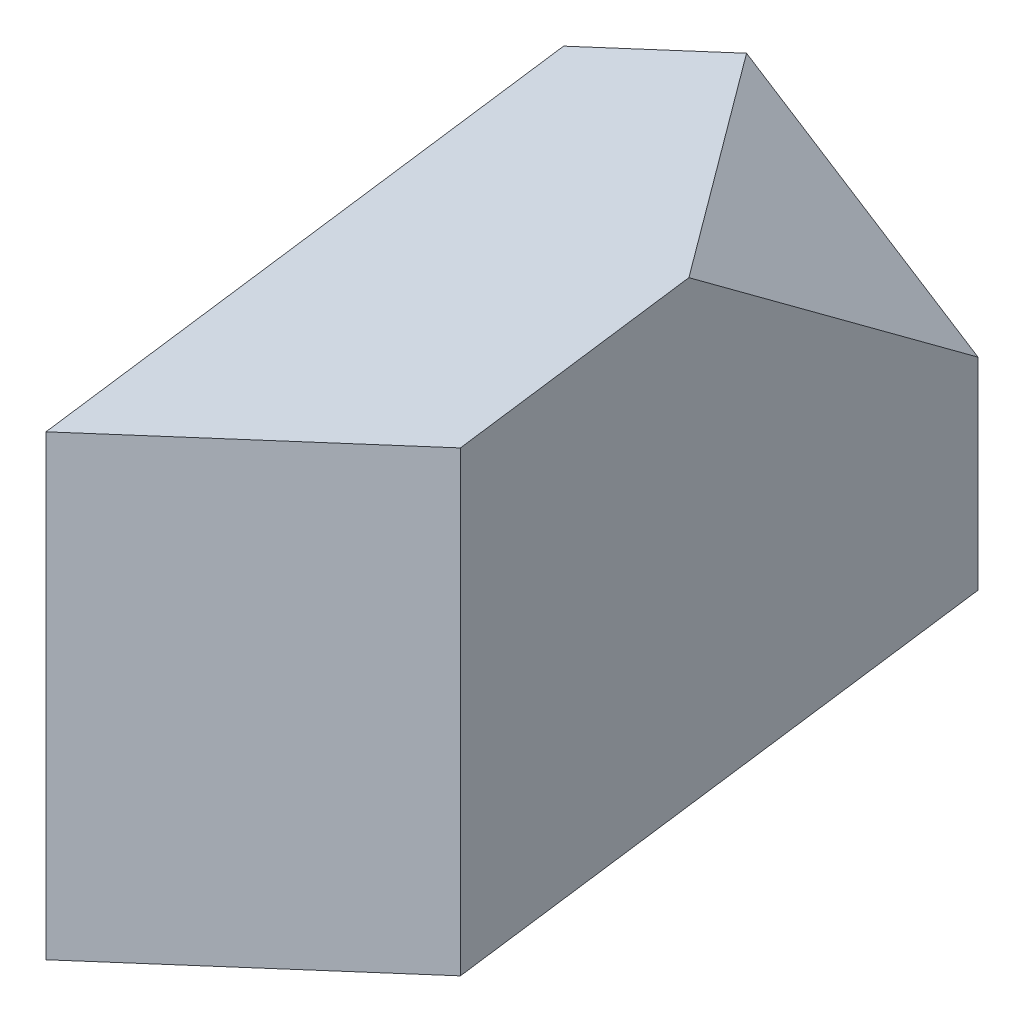
ISO-10303-21;
HEADER;
FILE_DESCRIPTION(('STEP AP214'),'2;1');
FILE_NAME('part.step','',(''),(''),'','','');
FILE_SCHEMA(('AUTOMOTIVE_DESIGN { 1 0 10303 214 1 1 1 1 }'));
ENDSEC;
DATA;
#1=APPLICATION_CONTEXT('core data for automotive mechanical design processes');
#2=APPLICATION_PROTOCOL_DEFINITION('international standard','automotive_design',2000,#1);
#3=PRODUCT_CONTEXT('',#1,'mechanical');
#4=PRODUCT('Part','Part','',(#3));
#5=PRODUCT_RELATED_PRODUCT_CATEGORY('part','',(#4));
#6=PRODUCT_DEFINITION_FORMATION('','',#4);
#7=PRODUCT_DEFINITION_CONTEXT('part definition',#1,'design');
#8=PRODUCT_DEFINITION('design','',#6,#7);
#9=PRODUCT_DEFINITION_SHAPE('','',#8);
#10=(LENGTH_UNIT() NAMED_UNIT(*) SI_UNIT(.MILLI.,.METRE.));
#11=(NAMED_UNIT(*) PLANE_ANGLE_UNIT() SI_UNIT($,.RADIAN.));
#12=(NAMED_UNIT(*) SI_UNIT($,.STERADIAN.) SOLID_ANGLE_UNIT());
#13=UNCERTAINTY_MEASURE_WITH_UNIT(LENGTH_MEASURE(1.E-05),#10,'distance_accuracy_value','');
#14=(GEOMETRIC_REPRESENTATION_CONTEXT(3) GLOBAL_UNCERTAINTY_ASSIGNED_CONTEXT((#13)) GLOBAL_UNIT_ASSIGNED_CONTEXT((#10,
#11,#12)) REPRESENTATION_CONTEXT('',''));
#15=CARTESIAN_POINT('',(0.,0.,0.));
#16=DIRECTION('',(0.,0.,1.));
#17=DIRECTION('',(1.,0.,0.));
#18=AXIS2_PLACEMENT_3D('',#15,#16,#17);
#19=CARTESIAN_POINT('',(0.,0.,0.));
#20=DIRECTION('',(0.,0.,-1.));
#21=DIRECTION('',(-1.,0.,0.));
#22=AXIS2_PLACEMENT_3D('',#19,#20,#21);
#23=PLANE('',#22);
#24=DIRECTION('',(0.,-1.,0.));
#25=VECTOR('',#24,1.);
#26=CARTESIAN_POINT('',(0.,0.,0.));
#27=LINE('',#26,#25);
#28=CARTESIAN_POINT('',(0.,60.,0.));
#29=VERTEX_POINT('',#28);
#30=CARTESIAN_POINT('',(0.,0.,0.));
#31=VERTEX_POINT('',#30);
#32=EDGE_CURVE('E108',#29,#31,#27,.T.);
#33=ORIENTED_EDGE('',*,*,#32,.T.);
#34=DIRECTION('',(0.906307787036651,0.422618261740697,0.));
#35=VECTOR('',#34,1.);
#36=CARTESIAN_POINT('',(0.,0.,0.));
#37=LINE('',#36,#35);
#38=CARTESIAN_POINT('',(54.3784672221991,25.3570957044419,0.));
#39=VERTEX_POINT('',#38);
#40=EDGE_CURVE('E99',#31,#39,#37,.T.);
#41=ORIENTED_EDGE('',*,*,#40,.T.);
#42=DIRECTION('',(0.,1.,0.));
#43=VECTOR('',#42,1.);
#44=CARTESIAN_POINT('',(54.3784672221991,25.3570957044419,0.));
#45=LINE('',#44,#43);
#46=CARTESIAN_POINT('',(54.3784672221991,85.3570957044419,0.));
#47=VERTEX_POINT('',#46);
#48=EDGE_CURVE('E102',#39,#47,#45,.T.);
#49=ORIENTED_EDGE('',*,*,#48,.T.);
#50=DIRECTION('',(-0.906307787036651,-0.422618261740697,0.));
#51=VECTOR('',#50,1.);
#52=CARTESIAN_POINT('',(0.,60.,0.));
#53=LINE('',#52,#51);
#54=EDGE_CURVE('E105',#47,#29,#53,.T.);
#55=ORIENTED_EDGE('',*,*,#54,.T.);
#56=EDGE_LOOP('',(#33,#41,#49,#55));
#57=FACE_BOUND('',#56,.T.);
#58=ADVANCED_FACE('F32',(#57),#23,.F.);
#59=CARTESIAN_POINT('',(17.3214521477791,27.1892336110995,-50.6034867487731));
#60=DIRECTION('',(0.,0.,-1.));
#61=DIRECTION('',(-1.,0.,0.));
#62=AXIS2_PLACEMENT_3D('',#59,#60,#61);
#63=PLANE('',#62);
#64=DIRECTION('',(-0.843391445812885,0.537299608346825,0.));
#65=VECTOR('',#64,1.);
#66=CARTESIAN_POINT('',(71.6999193699783,79.0349420383753,-50.6034867487731));
#67=LINE('',#66,#65);
#68=CARTESIAN_POINT('',(71.6999193699783,79.0349420383753,-50.6034867487731));
#69=VERTEX_POINT('',#68);
#70=CARTESIAN_POINT('',(41.3282881262817,98.3838050759462,-50.6034867487731));
#71=VERTEX_POINT('',#70);
#72=EDGE_CURVE('E46',#69,#71,#67,.T.);
#73=ORIENTED_EDGE('',*,*,#72,.F.);
#74=DIRECTION('',(0.,1.,0.));
#75=VECTOR('',#74,1.);
#76=CARTESIAN_POINT('',(71.6999193699782,52.5463293155414,-50.6034867487731));
#77=LINE('',#76,#75);
#78=CARTESIAN_POINT('',(71.6999193699782,52.5463293155414,-50.6034867487731));
#79=VERTEX_POINT('',#78);
#80=EDGE_CURVE('E89',#79,#69,#77,.T.);
#81=ORIENTED_EDGE('',*,*,#80,.F.);
#82=DIRECTION('',(0.906307787036651,0.422618261740697,0.));
#83=VECTOR('',#82,1.);
#84=CARTESIAN_POINT('',(17.3214521477791,27.1892336110995,-50.6034867487731));
#85=LINE('',#84,#83);
#86=CARTESIAN_POINT('',(17.3214521477791,27.1892336110995,-50.6034867487731));
#87=VERTEX_POINT('',#86);
#88=EDGE_CURVE('E11',#87,#79,#85,.T.);
#89=ORIENTED_EDGE('',*,*,#88,.F.);
#90=DIRECTION('',(0.,-1.,0.));
#91=VECTOR('',#90,1.);
#92=CARTESIAN_POINT('',(17.3214521477791,27.1892336110995,-50.6034867487731));
#93=LINE('',#92,#91);
#94=CARTESIAN_POINT('',(17.3214521477792,87.1892336110996,-50.6034867487731));
#95=VERTEX_POINT('',#94);
#96=EDGE_CURVE('E54',#95,#87,#93,.T.);
#97=ORIENTED_EDGE('',*,*,#96,.F.);
#98=DIRECTION('',(-0.906307787036651,-0.422618261740697,0.));
#99=VECTOR('',#98,1.);
#100=CARTESIAN_POINT('',(17.3214521477792,87.1892336110996,-50.6034867487731));
#101=LINE('',#100,#99);
#102=EDGE_CURVE('E91',#71,#95,#101,.T.);
#103=ORIENTED_EDGE('',*,*,#102,.F.);
#104=EDGE_LOOP('',(#73,#81,#89,#97,#103));
#105=FACE_BOUND('',#104,.T.);
#106=ADVANCED_FACE('F88',(#105),#63,.T.);
#107=CARTESIAN_POINT('',(54.3784672221991,25.3570957044419,0.));
#108=DIRECTION('',(-0.946108239580903,0.,-0.323850581282671));
#109=DIRECTION('',(-0.323850581282671,0.,0.946108239580903));
#110=AXIS2_PLACEMENT_3D('',#107,#108,#109);
#111=PLANE('',#110);
#112=ORIENTED_EDGE('',*,*,#80,.T.);
#113=DIRECTION('',(0.276048561282028,-0.522898702657443,-0.806457772343528));
#114=VECTOR('',#113,1.);
#115=CARTESIAN_POINT('',(71.6999193699783,79.0349420383753,-50.6034867487731));
#116=LINE('',#115,#114);
#117=CARTESIAN_POINT('',(62.0254878511928,97.3605136936931,-22.3402693818885));
#118=VERTEX_POINT('',#117);
#119=EDGE_CURVE('E77',#118,#69,#116,.T.);
#120=ORIENTED_EDGE('',*,*,#119,.F.);
#121=DIRECTION('',(0.288690869129651,0.453153893518326,-0.843391445812885));
#122=VECTOR('',#121,1.);
#123=CARTESIAN_POINT('',(54.3784672221991,85.3570957044419,0.));
#124=LINE('',#123,#122);
#125=EDGE_CURVE('E96',#47,#118,#124,.T.);
#126=ORIENTED_EDGE('',*,*,#125,.F.);
#127=ORIENTED_EDGE('',*,*,#48,.F.);
#128=DIRECTION('',(0.288690869129651,0.453153893518326,-0.843391445812885));
#129=VECTOR('',#128,1.);
#130=CARTESIAN_POINT('',(54.3784672221991,25.3570957044419,0.));
#131=LINE('',#130,#129);
#132=EDGE_CURVE('E95',#39,#79,#131,.T.);
#133=ORIENTED_EDGE('',*,*,#132,.T.);
#134=EDGE_LOOP('',(#112,#120,#126,#127,#133));
#135=FACE_BOUND('',#134,.T.);
#136=ADVANCED_FACE('F93',(#135),#111,.F.);
#137=CARTESIAN_POINT('',(0.,60.,0.));
#138=DIRECTION('',(0.399842619630232,-0.85746526491171,-0.323850581282671));
#139=DIRECTION('',(0.906307787036651,0.422618261740697,0.));
#140=AXIS2_PLACEMENT_3D('',#137,#138,#139);
#141=PLANE('',#140);
#142=ORIENTED_EDGE('',*,*,#125,.T.);
#143=DIRECTION('',(0.590570329174834,-0.0291984199066119,0.806457772343528));
#144=VECTOR('',#143,1.);
#145=CARTESIAN_POINT('',(62.0254878511928,97.3605136936931,-22.3402693818885));
#146=LINE('',#145,#144);
#147=EDGE_CURVE('E79',#71,#118,#146,.T.);
#148=ORIENTED_EDGE('',*,*,#147,.F.);
#149=ORIENTED_EDGE('',*,*,#102,.T.);
#150=DIRECTION('',(0.288690869129651,0.453153893518326,-0.843391445812885));
#151=VECTOR('',#150,1.);
#152=CARTESIAN_POINT('',(0.,60.,0.));
#153=LINE('',#152,#151);
#154=EDGE_CURVE('E110',#29,#95,#153,.T.);
#155=ORIENTED_EDGE('',*,*,#154,.F.);
#156=ORIENTED_EDGE('',*,*,#54,.F.);
#157=EDGE_LOOP('',(#142,#148,#149,#155,#156));
#158=FACE_BOUND('',#157,.T.);
#159=ADVANCED_FACE('F124',(#158),#141,.F.);
#160=CARTESIAN_POINT('',(0.,0.,0.));
#161=DIRECTION('',(0.946108239580904,0.,0.323850581282671));
#162=DIRECTION('',(0.323850581282671,0.,-0.946108239580904));
#163=AXIS2_PLACEMENT_3D('',#160,#161,#162);
#164=PLANE('',#163);
#165=DIRECTION('',(0.288690869129651,0.453153893518326,-0.843391445812885));
#166=VECTOR('',#165,1.);
#167=CARTESIAN_POINT('',(0.,0.,0.));
#168=LINE('',#167,#166);
#169=EDGE_CURVE('E39',#31,#87,#168,.T.);
#170=ORIENTED_EDGE('',*,*,#169,.F.);
#171=ORIENTED_EDGE('',*,*,#32,.F.);
#172=ORIENTED_EDGE('',*,*,#154,.T.);
#173=ORIENTED_EDGE('',*,*,#96,.T.);
#174=EDGE_LOOP('',(#170,#171,#172,#173));
#175=FACE_BOUND('',#174,.T.);
#176=ADVANCED_FACE('F122',(#175),#164,.F.);
#177=CARTESIAN_POINT('',(0.,0.,0.));
#178=DIRECTION('',(-0.399842619630232,0.85746526491171,0.323850581282671));
#179=DIRECTION('',(-0.906307787036651,-0.422618261740697,0.));
#180=AXIS2_PLACEMENT_3D('',#177,#178,#179);
#181=PLANE('',#180);
#182=ORIENTED_EDGE('',*,*,#88,.T.);
#183=ORIENTED_EDGE('',*,*,#132,.F.);
#184=ORIENTED_EDGE('',*,*,#40,.F.);
#185=ORIENTED_EDGE('',*,*,#169,.T.);
#186=EDGE_LOOP('',(#182,#183,#184,#185));
#187=FACE_BOUND('',#186,.T.);
#188=ADVANCED_FACE('F120',(#187),#181,.F.);
#189=CARTESIAN_POINT('',(58.6558537286698,92.071247611406,-39.6202665424586));
#190=DIRECTION('',(-0.505065162035641,-0.792793500351852,0.341156339377961));
#191=DIRECTION('',(0.843391445812885,-0.537299608346825,0.));
#192=AXIS2_PLACEMENT_3D('',#189,#190,#191);
#193=PLANE('',#192);
#194=ORIENTED_EDGE('',*,*,#119,.T.);
#195=ORIENTED_EDGE('',*,*,#72,.T.);
#196=ORIENTED_EDGE('',*,*,#147,.T.);
#197=EDGE_LOOP('',(#194,#195,#196));
#198=FACE_BOUND('',#197,.T.);
#199=ADVANCED_FACE('F78',(#198),#193,.F.);
#200=CLOSED_SHELL('',(#58,#106,#136,#159,#176,#188,#199));
#201=MANIFOLD_SOLID_BREP('B2',#200);
#202=ADVANCED_BREP_SHAPE_REPRESENTATION('',(#18,#201),#14);
#203=SHAPE_DEFINITION_REPRESENTATION(#9,#202);
ENDSEC;
END-ISO-10303-21;
